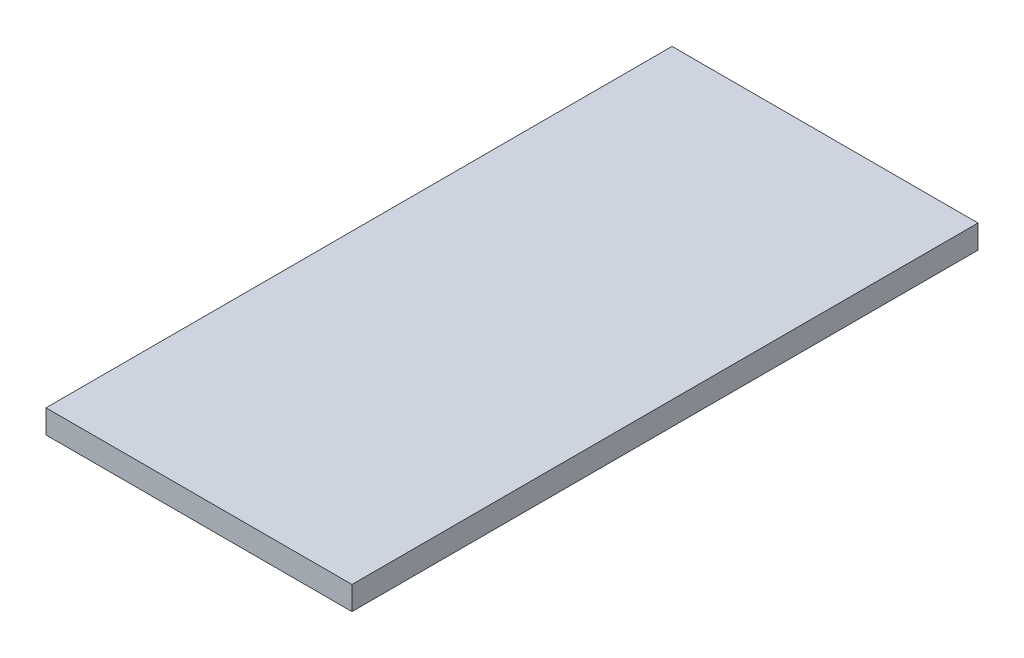
ISO-10303-21;
HEADER;
FILE_DESCRIPTION(('STEP AP214'),'2;1');
FILE_NAME('part.step','',(''),(''),'','','');
FILE_SCHEMA(('AUTOMOTIVE_DESIGN { 1 0 10303 214 1 1 1 1 }'));
ENDSEC;
DATA;
#1=APPLICATION_CONTEXT('core data for automotive mechanical design processes');
#2=APPLICATION_PROTOCOL_DEFINITION('international standard','automotive_design',2000,#1);
#3=PRODUCT_CONTEXT('',#1,'mechanical');
#4=PRODUCT('Part','Part','',(#3));
#5=PRODUCT_RELATED_PRODUCT_CATEGORY('part','',(#4));
#6=PRODUCT_DEFINITION_FORMATION('','',#4);
#7=PRODUCT_DEFINITION_CONTEXT('part definition',#1,'design');
#8=PRODUCT_DEFINITION('design','',#6,#7);
#9=PRODUCT_DEFINITION_SHAPE('','',#8);
#10=(LENGTH_UNIT() NAMED_UNIT(*) SI_UNIT(.MILLI.,.METRE.));
#11=(NAMED_UNIT(*) PLANE_ANGLE_UNIT() SI_UNIT($,.RADIAN.));
#12=(NAMED_UNIT(*) SI_UNIT($,.STERADIAN.) SOLID_ANGLE_UNIT());
#13=UNCERTAINTY_MEASURE_WITH_UNIT(LENGTH_MEASURE(1.E-05),#10,'distance_accuracy_value','');
#14=(GEOMETRIC_REPRESENTATION_CONTEXT(3) GLOBAL_UNCERTAINTY_ASSIGNED_CONTEXT((#13)) GLOBAL_UNIT_ASSIGNED_CONTEXT((#10,
#11,#12)) REPRESENTATION_CONTEXT('',''));
#15=CARTESIAN_POINT('',(0.,0.,0.));
#16=DIRECTION('',(0.,0.,1.));
#17=DIRECTION('',(1.,0.,0.));
#18=AXIS2_PLACEMENT_3D('',#15,#16,#17);
#19=CARTESIAN_POINT('',(0.,10.,0.));
#20=DIRECTION('',(1.,0.,0.));
#21=DIRECTION('',(0.,0.,-1.));
#22=AXIS2_PLACEMENT_3D('',#19,#20,#21);
#23=PLANE('',#22);
#24=DIRECTION('',(0.,0.,1.));
#25=VECTOR('',#24,1.);
#26=CARTESIAN_POINT('',(0.,0.,0.));
#27=LINE('',#26,#25);
#28=CARTESIAN_POINT('',(0.,0.,-266.));
#29=VERTEX_POINT('',#28);
#30=CARTESIAN_POINT('',(0.,0.,0.));
#31=VERTEX_POINT('',#30);
#32=EDGE_CURVE('E97',#29,#31,#27,.T.);
#33=ORIENTED_EDGE('',*,*,#32,.T.);
#34=DIRECTION('',(0.,-1.,0.));
#35=VECTOR('',#34,1.);
#36=CARTESIAN_POINT('',(0.,10.,0.));
#37=LINE('',#36,#35);
#38=CARTESIAN_POINT('',(0.,10.,0.));
#39=VERTEX_POINT('',#38);
#40=EDGE_CURVE('E11',#39,#31,#37,.T.);
#41=ORIENTED_EDGE('',*,*,#40,.F.);
#42=DIRECTION('',(0.,0.,1.));
#43=VECTOR('',#42,1.);
#44=CARTESIAN_POINT('',(0.,10.,0.));
#45=LINE('',#44,#43);
#46=CARTESIAN_POINT('',(0.,10.,-266.));
#47=VERTEX_POINT('',#46);
#48=EDGE_CURVE('E85',#47,#39,#45,.T.);
#49=ORIENTED_EDGE('',*,*,#48,.F.);
#50=DIRECTION('',(0.,-1.,0.));
#51=VECTOR('',#50,1.);
#52=CARTESIAN_POINT('',(0.,10.,-266.));
#53=LINE('',#52,#51);
#54=EDGE_CURVE('E93',#47,#29,#53,.T.);
#55=ORIENTED_EDGE('',*,*,#54,.T.);
#56=EDGE_LOOP('',(#33,#41,#49,#55));
#57=FACE_BOUND('',#56,.T.);
#58=ADVANCED_FACE('F34',(#57),#23,.F.);
#59=CARTESIAN_POINT('',(0.,10.,0.));
#60=DIRECTION('',(0.,0.,-1.));
#61=DIRECTION('',(-1.,0.,0.));
#62=AXIS2_PLACEMENT_3D('',#59,#60,#61);
#63=PLANE('',#62);
#64=DIRECTION('',(1.,0.,0.));
#65=VECTOR('',#64,1.);
#66=CARTESIAN_POINT('',(0.,0.,0.));
#67=LINE('',#66,#65);
#68=CARTESIAN_POINT('',(130.,0.,0.));
#69=VERTEX_POINT('',#68);
#70=EDGE_CURVE('E89',#31,#69,#67,.T.);
#71=ORIENTED_EDGE('',*,*,#70,.T.);
#72=DIRECTION('',(0.,-1.,0.));
#73=VECTOR('',#72,1.);
#74=CARTESIAN_POINT('',(130.,10.,0.));
#75=LINE('',#74,#73);
#76=CARTESIAN_POINT('',(130.,10.,0.));
#77=VERTEX_POINT('',#76);
#78=EDGE_CURVE('E42',#77,#69,#75,.T.);
#79=ORIENTED_EDGE('',*,*,#78,.F.);
#80=DIRECTION('',(1.,0.,0.));
#81=VECTOR('',#80,1.);
#82=CARTESIAN_POINT('',(0.,10.,0.));
#83=LINE('',#82,#81);
#84=EDGE_CURVE('E80',#39,#77,#83,.T.);
#85=ORIENTED_EDGE('',*,*,#84,.F.);
#86=ORIENTED_EDGE('',*,*,#40,.T.);
#87=EDGE_LOOP('',(#71,#79,#85,#86));
#88=FACE_BOUND('',#87,.T.);
#89=ADVANCED_FACE('F88',(#88),#63,.F.);
#90=CARTESIAN_POINT('',(130.,10.,0.));
#91=DIRECTION('',(-1.,0.,0.));
#92=DIRECTION('',(0.,0.,1.));
#93=AXIS2_PLACEMENT_3D('',#90,#91,#92);
#94=PLANE('',#93);
#95=DIRECTION('',(0.,0.,-1.));
#96=VECTOR('',#95,1.);
#97=CARTESIAN_POINT('',(130.,0.,0.));
#98=LINE('',#97,#96);
#99=CARTESIAN_POINT('',(130.,0.,-266.));
#100=VERTEX_POINT('',#99);
#101=EDGE_CURVE('E67',#69,#100,#98,.T.);
#102=ORIENTED_EDGE('',*,*,#101,.T.);
#103=DIRECTION('',(0.,-1.,0.));
#104=VECTOR('',#103,1.);
#105=CARTESIAN_POINT('',(130.,10.,-266.));
#106=LINE('',#105,#104);
#107=CARTESIAN_POINT('',(130.,10.,-266.));
#108=VERTEX_POINT('',#107);
#109=EDGE_CURVE('E90',#108,#100,#106,.T.);
#110=ORIENTED_EDGE('',*,*,#109,.F.);
#111=DIRECTION('',(0.,0.,-1.));
#112=VECTOR('',#111,1.);
#113=CARTESIAN_POINT('',(130.,10.,0.));
#114=LINE('',#113,#112);
#115=EDGE_CURVE('E83',#77,#108,#114,.T.);
#116=ORIENTED_EDGE('',*,*,#115,.F.);
#117=ORIENTED_EDGE('',*,*,#78,.T.);
#118=EDGE_LOOP('',(#102,#110,#116,#117));
#119=FACE_BOUND('',#118,.T.);
#120=ADVANCED_FACE('F91',(#119),#94,.F.);
#121=CARTESIAN_POINT('',(0.,10.,-266.));
#122=DIRECTION('',(0.,0.,1.));
#123=DIRECTION('',(1.,0.,0.));
#124=AXIS2_PLACEMENT_3D('',#121,#122,#123);
#125=PLANE('',#124);
#126=DIRECTION('',(-1.,0.,0.));
#127=VECTOR('',#126,1.);
#128=CARTESIAN_POINT('',(0.,0.,-266.));
#129=LINE('',#128,#127);
#130=EDGE_CURVE('E73',#100,#29,#129,.T.);
#131=ORIENTED_EDGE('',*,*,#130,.T.);
#132=ORIENTED_EDGE('',*,*,#54,.F.);
#133=DIRECTION('',(-1.,0.,0.));
#134=VECTOR('',#133,1.);
#135=CARTESIAN_POINT('',(0.,10.,-266.));
#136=LINE('',#135,#134);
#137=EDGE_CURVE('E50',#108,#47,#136,.T.);
#138=ORIENTED_EDGE('',*,*,#137,.F.);
#139=ORIENTED_EDGE('',*,*,#109,.T.);
#140=EDGE_LOOP('',(#131,#132,#138,#139));
#141=FACE_BOUND('',#140,.T.);
#142=ADVANCED_FACE('F104',(#141),#125,.F.);
#143=CARTESIAN_POINT('',(0.,10.,0.));
#144=DIRECTION('',(0.,-1.,0.));
#145=DIRECTION('',(0.,0.,-1.));
#146=AXIS2_PLACEMENT_3D('',#143,#144,#145);
#147=PLANE('',#146);
#148=ORIENTED_EDGE('',*,*,#48,.T.);
#149=ORIENTED_EDGE('',*,*,#84,.T.);
#150=ORIENTED_EDGE('',*,*,#115,.T.);
#151=ORIENTED_EDGE('',*,*,#137,.T.);
#152=EDGE_LOOP('',(#148,#149,#150,#151));
#153=FACE_BOUND('',#152,.T.);
#154=ADVANCED_FACE('F81',(#153),#147,.F.);
#155=CARTESIAN_POINT('',(0.,0.,0.));
#156=DIRECTION('',(0.,-1.,0.));
#157=DIRECTION('',(0.,0.,-1.));
#158=AXIS2_PLACEMENT_3D('',#155,#156,#157);
#159=PLANE('',#158);
#160=ORIENTED_EDGE('',*,*,#32,.F.);
#161=ORIENTED_EDGE('',*,*,#130,.F.);
#162=ORIENTED_EDGE('',*,*,#101,.F.);
#163=ORIENTED_EDGE('',*,*,#70,.F.);
#164=EDGE_LOOP('',(#160,#161,#162,#163));
#165=FACE_BOUND('',#164,.T.);
#166=ADVANCED_FACE('F107',(#165),#159,.T.);
#167=CLOSED_SHELL('',(#58,#89,#120,#142,#154,#166));
#168=MANIFOLD_SOLID_BREP('B2',#167);
#169=ADVANCED_BREP_SHAPE_REPRESENTATION('',(#18,#168),#14);
#170=SHAPE_DEFINITION_REPRESENTATION(#9,#169);
ENDSEC;
END-ISO-10303-21;
